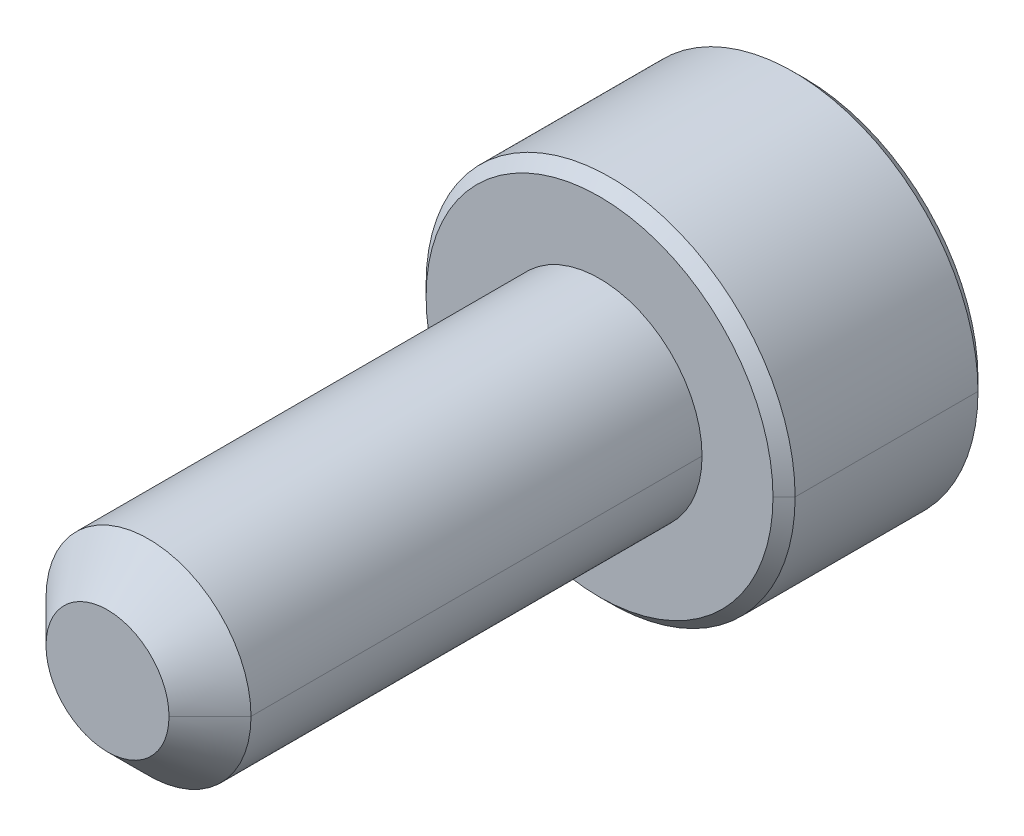
ISO-10303-21;
HEADER;
FILE_DESCRIPTION(('STEP AP214'),'2;1');
FILE_NAME('part.step','',(''),(''),'','','');
FILE_SCHEMA(('AUTOMOTIVE_DESIGN { 1 0 10303 214 1 1 1 1 }'));
ENDSEC;
DATA;
#1=APPLICATION_CONTEXT('core data for automotive mechanical design processes');
#2=APPLICATION_PROTOCOL_DEFINITION('international standard','automotive_design',2000,#1);
#3=PRODUCT_CONTEXT('',#1,'mechanical');
#4=PRODUCT('Part','Part','',(#3));
#5=PRODUCT_RELATED_PRODUCT_CATEGORY('part','',(#4));
#6=PRODUCT_DEFINITION_FORMATION('','',#4);
#7=PRODUCT_DEFINITION_CONTEXT('part definition',#1,'design');
#8=PRODUCT_DEFINITION('design','',#6,#7);
#9=PRODUCT_DEFINITION_SHAPE('','',#8);
#10=(LENGTH_UNIT() NAMED_UNIT(*) SI_UNIT(.MILLI.,.METRE.));
#11=(NAMED_UNIT(*) PLANE_ANGLE_UNIT() SI_UNIT($,.RADIAN.));
#12=(NAMED_UNIT(*) SI_UNIT($,.STERADIAN.) SOLID_ANGLE_UNIT());
#13=UNCERTAINTY_MEASURE_WITH_UNIT(LENGTH_MEASURE(1.E-05),#10,'distance_accuracy_value','');
#14=(GEOMETRIC_REPRESENTATION_CONTEXT(3) GLOBAL_UNCERTAINTY_ASSIGNED_CONTEXT((#13)) GLOBAL_UNIT_ASSIGNED_CONTEXT((#10,
#11,#12)) REPRESENTATION_CONTEXT('',''));
#15=CARTESIAN_POINT('',(0.,0.,0.));
#16=DIRECTION('',(0.,0.,1.));
#17=DIRECTION('',(1.,0.,0.));
#18=AXIS2_PLACEMENT_3D('',#15,#16,#17);
#19=CARTESIAN_POINT('',(0.,0.,0.));
#20=DIRECTION('',(0.,0.,-1.));
#21=DIRECTION('',(-1.,0.,0.));
#22=AXIS2_PLACEMENT_3D('',#19,#20,#21);
#23=CONICAL_SURFACE('',#22,0.75,0.785398163397448);
#24=CARTESIAN_POINT('',(0.,0.,0.));
#25=DIRECTION('',(0.,0.,1.));
#26=DIRECTION('',(1.,0.,0.));
#27=AXIS2_PLACEMENT_3D('',#24,#25,#26);
#28=CIRCLE('',#27,0.75);
#29=CARTESIAN_POINT('',(0.75,0.,0.));
#30=VERTEX_POINT('',#29);
#31=CARTESIAN_POINT('',(-0.75,0.,0.));
#32=VERTEX_POINT('',#31);
#33=EDGE_CURVE('E43',#30,#32,#28,.T.);
#34=ORIENTED_EDGE('',*,*,#33,.F.);
#35=DIRECTION('',(0.707106781186547,0.,-0.707106781186548));
#36=VECTOR('',#35,1.);
#37=CARTESIAN_POINT('',(0.75,0.,0.));
#38=LINE('',#37,#36);
#39=CARTESIAN_POINT('',(1.24999999999997,0.,-0.500000000000028));
#40=VERTEX_POINT('',#39);
#41=EDGE_CURVE('E11',#30,#40,#38,.T.);
#42=ORIENTED_EDGE('',*,*,#41,.T.);
#43=CARTESIAN_POINT('',(0.,0.,-0.500000000000028));
#44=DIRECTION('',(0.,0.,-1.));
#45=DIRECTION('',(1.,0.,0.));
#46=AXIS2_PLACEMENT_3D('',#43,#44,#45);
#47=CIRCLE('',#46,1.25);
#48=CARTESIAN_POINT('',(-1.25000000000003,0.,-0.500000000000028));
#49=VERTEX_POINT('',#48);
#50=EDGE_CURVE('E437',#49,#40,#47,.T.);
#51=ORIENTED_EDGE('',*,*,#50,.F.);
#52=DIRECTION('',(-0.707106781186547,0.,-0.707106781186548));
#53=VECTOR('',#52,1.);
#54=CARTESIAN_POINT('',(-0.75,0.,0.));
#55=LINE('',#54,#53);
#56=EDGE_CURVE('E476',#32,#49,#55,.T.);
#57=ORIENTED_EDGE('',*,*,#56,.F.);
#58=EDGE_LOOP('',(#34,#42,#51,#57));
#59=FACE_BOUND('',#58,.T.);
#60=ADVANCED_FACE('F16',(#59),#23,.T.);
#61=CARTESIAN_POINT('',(1.10154940724527E-13,0.,-6.135));
#62=DIRECTION('',(0.,0.,-1.));
#63=DIRECTION('',(-1.,0.,0.));
#64=AXIS2_PLACEMENT_3D('',#61,#62,#63);
#65=CONICAL_SURFACE('',#64,2.25,0.785398163397456);
#66=CARTESIAN_POINT('',(0.,0.,-6.));
#67=DIRECTION('',(0.,0.,1.));
#68=DIRECTION('',(-1.,0.,0.));
#69=AXIS2_PLACEMENT_3D('',#66,#67,#68);
#70=CIRCLE('',#69,2.115);
#71=CARTESIAN_POINT('',(2.11500000000005,0.,-6.));
#72=VERTEX_POINT('',#71);
#73=CARTESIAN_POINT('',(-2.11499999999994,0.,-6.));
#74=VERTEX_POINT('',#73);
#75=EDGE_CURVE('E328',#72,#74,#70,.T.);
#76=ORIENTED_EDGE('',*,*,#75,.F.);
#77=DIRECTION('',(0.707106781186554,0.,-0.707106781186541));
#78=VECTOR('',#77,1.);
#79=CARTESIAN_POINT('',(2.2500000000001,0.,-6.135));
#80=LINE('',#79,#78);
#81=CARTESIAN_POINT('',(2.25000000000011,0.,-6.135));
#82=VERTEX_POINT('',#81);
#83=EDGE_CURVE('E29',#72,#82,#80,.T.);
#84=ORIENTED_EDGE('',*,*,#83,.T.);
#85=CARTESIAN_POINT('',(1.10154940724527E-13,0.,-6.135));
#86=DIRECTION('',(0.,0.,-1.));
#87=DIRECTION('',(-1.,0.,0.));
#88=AXIS2_PLACEMENT_3D('',#85,#86,#87);
#89=CIRCLE('',#88,2.25);
#90=CARTESIAN_POINT('',(-2.24999999999989,0.,-6.135));
#91=VERTEX_POINT('',#90);
#92=EDGE_CURVE('E443',#91,#82,#89,.T.);
#93=ORIENTED_EDGE('',*,*,#92,.F.);
#94=DIRECTION('',(-0.707106781186554,0.,-0.707106781186542));
#95=VECTOR('',#94,1.);
#96=CARTESIAN_POINT('',(-2.24999999999988,0.,-6.135));
#97=LINE('',#96,#95);
#98=EDGE_CURVE('E142',#74,#91,#97,.T.);
#99=ORIENTED_EDGE('',*,*,#98,.F.);
#100=EDGE_LOOP('',(#76,#84,#93,#99));
#101=FACE_BOUND('',#100,.T.);
#102=ADVANCED_FACE('F242',(#101),#65,.T.);
#103=CARTESIAN_POINT('',(0.,0.,-8.5));
#104=DIRECTION('',(0.,0.,1.));
#105=DIRECTION('',(1.,0.,0.));
#106=AXIS2_PLACEMENT_3D('',#103,#104,#105);
#107=CONICAL_SURFACE('',#106,2.115,0.785398163397446);
#108=CARTESIAN_POINT('',(0.,0.,-8.5));
#109=DIRECTION('',(0.,0.,-1.));
#110=DIRECTION('',(-1.,0.,0.));
#111=AXIS2_PLACEMENT_3D('',#108,#109,#110);
#112=CIRCLE('',#111,2.115);
#113=CARTESIAN_POINT('',(-2.11499999999995,0.,-8.5));
#114=VERTEX_POINT('',#113);
#115=CARTESIAN_POINT('',(2.11500000000006,0.,-8.5));
#116=VERTEX_POINT('',#115);
#117=EDGE_CURVE('E157',#114,#116,#112,.T.);
#118=ORIENTED_EDGE('',*,*,#117,.F.);
#119=DIRECTION('',(-0.707106781186547,0.,0.707106781186548));
#120=VECTOR('',#119,1.);
#121=CARTESIAN_POINT('',(-2.11499999999994,0.,-8.5));
#122=LINE('',#121,#120);
#123=CARTESIAN_POINT('',(-2.24999999999997,0.,-8.365));
#124=VERTEX_POINT('',#123);
#125=EDGE_CURVE('E187',#114,#124,#122,.T.);
#126=ORIENTED_EDGE('',*,*,#125,.T.);
#127=CARTESIAN_POINT('',(0.,0.,-8.365));
#128=DIRECTION('',(0.,0.,1.));
#129=DIRECTION('',(-1.,0.,0.));
#130=AXIS2_PLACEMENT_3D('',#127,#128,#129);
#131=CIRCLE('',#130,2.25);
#132=CARTESIAN_POINT('',(2.25000000000003,0.,-8.365));
#133=VERTEX_POINT('',#132);
#134=EDGE_CURVE('E169',#133,#124,#131,.T.);
#135=ORIENTED_EDGE('',*,*,#134,.F.);
#136=DIRECTION('',(0.707106781186547,0.,0.707106781186548));
#137=VECTOR('',#136,1.);
#138=CARTESIAN_POINT('',(2.11500000000005,0.,-8.5));
#139=LINE('',#138,#137);
#140=EDGE_CURVE('E166',#116,#133,#139,.T.);
#141=ORIENTED_EDGE('',*,*,#140,.F.);
#142=EDGE_LOOP('',(#118,#126,#135,#141));
#143=FACE_BOUND('',#142,.T.);
#144=ADVANCED_FACE('F167',(#143),#107,.T.);
#145=CARTESIAN_POINT('',(0.,0.,-8.5));
#146=DIRECTION('',(0.,0.,-1.));
#147=DIRECTION('',(-1.,0.,0.));
#148=AXIS2_PLACEMENT_3D('',#145,#146,#147);
#149=CONICAL_SURFACE('',#148,1.15470053837925,0.78539816339745);
#150=CARTESIAN_POINT('',(-0.999999999999945,0.,-8.34529946162075));
#151=CARTESIAN_POINT('',(-0.999999999999945,0.267949192430957,-8.34529946162075));
#152=CARTESIAN_POINT('',(-0.999999999999945,0.57735026918964,-8.49999999999995));
#153=B_SPLINE_CURVE_WITH_KNOTS('',2,(#150,#151,#152),.UNSPECIFIED.,.F.,.F.,(3,3),(0.,1.),.UNSPECIFIED.);
#154=CARTESIAN_POINT('',(-0.999999999999945,0.,-8.34529946162074));
#155=VERTEX_POINT('',#154);
#156=CARTESIAN_POINT('',(-1.,0.57735026918964,-8.5));
#157=VERTEX_POINT('',#156);
#158=EDGE_CURVE('E392',#155,#157,#153,.T.);
#159=ORIENTED_EDGE('',*,*,#158,.F.);
#160=DIRECTION('',(-0.707106781186549,0.,-0.707106781186546));
#161=VECTOR('',#160,1.);
#162=CARTESIAN_POINT('',(-1.15470053837919,0.,-8.5));
#163=LINE('',#162,#161);
#164=CARTESIAN_POINT('',(-1.15470053837919,0.,-8.5));
#165=VERTEX_POINT('',#164);
#166=EDGE_CURVE('E209',#155,#165,#163,.T.);
#167=ORIENTED_EDGE('',*,*,#166,.T.);
#168=CARTESIAN_POINT('',(0.,0.,-8.5));
#169=DIRECTION('',(0.,0.,-1.));
#170=DIRECTION('',(-1.,0.,0.));
#171=AXIS2_PLACEMENT_3D('',#168,#169,#170);
#172=CIRCLE('',#171,1.15470053837925);
#173=EDGE_CURVE('E397',#165,#157,#172,.T.);
#174=ORIENTED_EDGE('',*,*,#173,.T.);
#175=EDGE_LOOP('',(#159,#167,#174));
#176=FACE_BOUND('',#175,.T.);
#177=ADVANCED_FACE('F245',(#176),#149,.F.);
#178=CARTESIAN_POINT('',(0.,0.,-8.5));
#179=DIRECTION('',(0.,0.,1.));
#180=DIRECTION('',(1.,0.,0.));
#181=AXIS2_PLACEMENT_3D('',#178,#179,#180);
#182=CYLINDRICAL_SURFACE('',#181,2.25);
#183=ORIENTED_EDGE('',*,*,#134,.T.);
#184=DIRECTION('',(0.,0.,1.));
#185=VECTOR('',#184,1.);
#186=CARTESIAN_POINT('',(-2.24999999999994,0.,-8.5));
#187=LINE('',#186,#185);
#188=EDGE_CURVE('E462',#124,#91,#187,.T.);
#189=ORIENTED_EDGE('',*,*,#188,.T.);
#190=ORIENTED_EDGE('',*,*,#92,.T.);
#191=DIRECTION('',(0.,0.,1.));
#192=VECTOR('',#191,1.);
#193=CARTESIAN_POINT('',(2.25000000000005,0.,-8.5));
#194=LINE('',#193,#192);
#195=EDGE_CURVE('E197',#133,#82,#194,.T.);
#196=ORIENTED_EDGE('',*,*,#195,.F.);
#197=EDGE_LOOP('',(#183,#189,#190,#196));
#198=FACE_BOUND('',#197,.T.);
#199=ADVANCED_FACE('F407',(#198),#182,.T.);
#200=CARTESIAN_POINT('',(0.,0.,-6.));
#201=DIRECTION('',(0.,0.,1.));
#202=DIRECTION('',(1.,0.,0.));
#203=AXIS2_PLACEMENT_3D('',#200,#201,#202);
#204=CYLINDRICAL_SURFACE('',#203,1.25);
#205=CARTESIAN_POINT('',(0.,0.,-6.));
#206=DIRECTION('',(0.,0.,1.));
#207=DIRECTION('',(-1.,0.,0.));
#208=AXIS2_PLACEMENT_3D('',#205,#206,#207);
#209=CIRCLE('',#208,1.25);
#210=CARTESIAN_POINT('',(1.25000000000005,0.,-6.));
#211=VERTEX_POINT('',#210);
#212=CARTESIAN_POINT('',(-1.24999999999995,0.,-6.));
#213=VERTEX_POINT('',#212);
#214=EDGE_CURVE('E436',#211,#213,#209,.T.);
#215=ORIENTED_EDGE('',*,*,#214,.T.);
#216=DIRECTION('',(0.,0.,1.));
#217=VECTOR('',#216,1.);
#218=CARTESIAN_POINT('',(-1.24999999999994,0.,-6.));
#219=LINE('',#218,#217);
#220=EDGE_CURVE('E426',#213,#49,#219,.T.);
#221=ORIENTED_EDGE('',*,*,#220,.T.);
#222=ORIENTED_EDGE('',*,*,#50,.T.);
#223=DIRECTION('',(0.,0.,1.));
#224=VECTOR('',#223,1.);
#225=CARTESIAN_POINT('',(1.25000000000005,0.,-6.));
#226=LINE('',#225,#224);
#227=EDGE_CURVE('E440',#211,#40,#226,.T.);
#228=ORIENTED_EDGE('',*,*,#227,.F.);
#229=EDGE_LOOP('',(#215,#221,#222,#228));
#230=FACE_BOUND('',#229,.T.);
#231=ADVANCED_FACE('F413',(#230),#204,.T.);
#232=CARTESIAN_POINT('',(0.,0.,-6.));
#233=DIRECTION('',(0.,0.,1.));
#234=DIRECTION('',(1.,0.,0.));
#235=AXIS2_PLACEMENT_3D('',#232,#233,#234);
#236=CYLINDRICAL_SURFACE('',#235,1.25);
#237=ORIENTED_EDGE('',*,*,#220,.F.);
#238=CARTESIAN_POINT('',(0.,0.,-6.));
#239=DIRECTION('',(0.,0.,1.));
#240=DIRECTION('',(-1.,0.,0.));
#241=AXIS2_PLACEMENT_3D('',#238,#239,#240);
#242=CIRCLE('',#241,1.25);
#243=EDGE_CURVE('E429',#213,#211,#242,.T.);
#244=ORIENTED_EDGE('',*,*,#243,.T.);
#245=ORIENTED_EDGE('',*,*,#227,.T.);
#246=CARTESIAN_POINT('',(0.,0.,-0.500000000000028));
#247=DIRECTION('',(0.,0.,-1.));
#248=DIRECTION('',(1.,0.,0.));
#249=AXIS2_PLACEMENT_3D('',#246,#247,#248);
#250=CIRCLE('',#249,1.25);
#251=EDGE_CURVE('E431',#40,#49,#250,.T.);
#252=ORIENTED_EDGE('',*,*,#251,.T.);
#253=EDGE_LOOP('',(#237,#244,#245,#252));
#254=FACE_BOUND('',#253,.T.);
#255=ADVANCED_FACE('F410',(#254),#236,.T.);
#256=CARTESIAN_POINT('',(0.,0.,0.));
#257=DIRECTION('',(0.,0.,1.));
#258=DIRECTION('',(1.,0.,0.));
#259=AXIS2_PLACEMENT_3D('',#256,#257,#258);
#260=PLANE('',#259);
#261=CARTESIAN_POINT('',(0.,0.,0.));
#262=DIRECTION('',(0.,0.,1.));
#263=DIRECTION('',(1.,0.,0.));
#264=AXIS2_PLACEMENT_3D('',#261,#262,#263);
#265=CIRCLE('',#264,0.75);
#266=EDGE_CURVE('E461',#32,#30,#265,.T.);
#267=ORIENTED_EDGE('',*,*,#266,.T.);
#268=ORIENTED_EDGE('',*,*,#33,.T.);
#269=EDGE_LOOP('',(#267,#268));
#270=FACE_BOUND('',#269,.T.);
#271=ADVANCED_FACE('F412',(#270),#260,.T.);
#272=CARTESIAN_POINT('',(0.,0.,-8.5));
#273=DIRECTION('',(0.,0.,1.));
#274=DIRECTION('',(1.,0.,0.));
#275=AXIS2_PLACEMENT_3D('',#272,#273,#274);
#276=CYLINDRICAL_SURFACE('',#275,2.25);
#277=ORIENTED_EDGE('',*,*,#188,.F.);
#278=CARTESIAN_POINT('',(0.,0.,-8.365));
#279=DIRECTION('',(0.,0.,1.));
#280=DIRECTION('',(-1.,0.,0.));
#281=AXIS2_PLACEMENT_3D('',#278,#279,#280);
#282=CIRCLE('',#281,2.25);
#283=EDGE_CURVE('E456',#124,#133,#282,.T.);
#284=ORIENTED_EDGE('',*,*,#283,.T.);
#285=ORIENTED_EDGE('',*,*,#195,.T.);
#286=CARTESIAN_POINT('',(1.10154940724527E-13,0.,-6.135));
#287=DIRECTION('',(0.,0.,-1.));
#288=DIRECTION('',(-1.,0.,0.));
#289=AXIS2_PLACEMENT_3D('',#286,#287,#288);
#290=CIRCLE('',#289,2.25);
#291=EDGE_CURVE('E189',#82,#91,#290,.T.);
#292=ORIENTED_EDGE('',*,*,#291,.T.);
#293=EDGE_LOOP('',(#277,#284,#285,#292));
#294=FACE_BOUND('',#293,.T.);
#295=ADVANCED_FACE('F408',(#294),#276,.T.);
#296=CARTESIAN_POINT('',(0.,0.,-8.5));
#297=DIRECTION('',(0.,0.,-1.));
#298=DIRECTION('',(0.,-1.,0.));
#299=AXIS2_PLACEMENT_3D('',#296,#297,#298);
#300=PLANE('',#299);
#301=CARTESIAN_POINT('',(0.,0.,-8.5));
#302=DIRECTION('',(0.,0.,-1.));
#303=DIRECTION('',(-1.,0.,0.));
#304=AXIS2_PLACEMENT_3D('',#301,#302,#303);
#305=CIRCLE('',#304,2.115);
#306=EDGE_CURVE('E182',#116,#114,#305,.T.);
#307=ORIENTED_EDGE('',*,*,#306,.T.);
#308=ORIENTED_EDGE('',*,*,#117,.T.);
#309=EDGE_LOOP('',(#307,#308));
#310=FACE_BOUND('',#309,.T.);
#311=CARTESIAN_POINT('',(0.,0.,-8.5));
#312=DIRECTION('',(0.,0.,-1.));
#313=DIRECTION('',(-1.,0.,0.));
#314=AXIS2_PLACEMENT_3D('',#311,#312,#313);
#315=CIRCLE('',#314,1.15470053837925);
#316=CARTESIAN_POINT('',(0.,1.15470053837928,-8.5));
#317=VERTEX_POINT('',#316);
#318=EDGE_CURVE('E205',#157,#317,#315,.T.);
#319=ORIENTED_EDGE('',*,*,#318,.F.);
#320=ORIENTED_EDGE('',*,*,#173,.F.);
#321=CARTESIAN_POINT('',(0.,0.,-8.5));
#322=DIRECTION('',(0.,0.,-1.));
#323=DIRECTION('',(-1.,0.,0.));
#324=AXIS2_PLACEMENT_3D('',#321,#322,#323);
#325=CIRCLE('',#324,1.15470053837925);
#326=CARTESIAN_POINT('',(-0.999999999999917,-0.577350269189591,-8.5));
#327=VERTEX_POINT('',#326);
#328=EDGE_CURVE('E321',#327,#165,#325,.T.);
#329=ORIENTED_EDGE('',*,*,#328,.F.);
#330=CARTESIAN_POINT('',(0.,0.,-8.5));
#331=DIRECTION('',(0.,0.,-1.));
#332=DIRECTION('',(-1.,0.,0.));
#333=AXIS2_PLACEMENT_3D('',#330,#331,#332);
#334=CIRCLE('',#333,1.15470053837925);
#335=CARTESIAN_POINT('',(0.,-1.15470053837923,-8.5));
#336=VERTEX_POINT('',#335);
#337=EDGE_CURVE('E274',#336,#327,#334,.T.);
#338=ORIENTED_EDGE('',*,*,#337,.F.);
#339=CARTESIAN_POINT('',(0.,0.,-8.5));
#340=DIRECTION('',(0.,0.,-1.));
#341=DIRECTION('',(-1.,0.,0.));
#342=AXIS2_PLACEMENT_3D('',#339,#340,#341);
#343=CIRCLE('',#342,1.15470053837925);
#344=CARTESIAN_POINT('',(1.,-0.577350269189584,-8.5));
#345=VERTEX_POINT('',#344);
#346=EDGE_CURVE('E264',#345,#336,#343,.T.);
#347=ORIENTED_EDGE('',*,*,#346,.F.);
#348=CARTESIAN_POINT('',(0.,0.,-8.5));
#349=DIRECTION('',(0.,0.,-1.));
#350=DIRECTION('',(-1.,0.,0.));
#351=AXIS2_PLACEMENT_3D('',#348,#349,#350);
#352=CIRCLE('',#351,1.15470053837925);
#353=CARTESIAN_POINT('',(1.00000000000006,0.577350269189633,-8.5));
#354=VERTEX_POINT('',#353);
#355=EDGE_CURVE('E273',#354,#345,#352,.T.);
#356=ORIENTED_EDGE('',*,*,#355,.F.);
#357=CARTESIAN_POINT('',(0.,0.,-8.5));
#358=DIRECTION('',(0.,0.,-1.));
#359=DIRECTION('',(-1.,0.,0.));
#360=AXIS2_PLACEMENT_3D('',#357,#358,#359);
#361=CIRCLE('',#360,1.15470053837925);
#362=EDGE_CURVE('E324',#317,#354,#361,.T.);
#363=ORIENTED_EDGE('',*,*,#362,.F.);
#364=EDGE_LOOP('',(#319,#320,#329,#338,#347,#356,#363));
#365=FACE_BOUND('',#364,.T.);
#366=ADVANCED_FACE('F180',(#310,#365),#300,.T.);
#367=CARTESIAN_POINT('',(0.,0.,-6.));
#368=DIRECTION('',(0.,0.,-1.));
#369=DIRECTION('',(0.,-1.,0.));
#370=AXIS2_PLACEMENT_3D('',#367,#368,#369);
#371=PLANE('',#370);
#372=CARTESIAN_POINT('',(0.,0.,-6.));
#373=DIRECTION('',(0.,0.,1.));
#374=DIRECTION('',(-1.,0.,0.));
#375=AXIS2_PLACEMENT_3D('',#372,#373,#374);
#376=CIRCLE('',#375,2.115);
#377=EDGE_CURVE('E184',#74,#72,#376,.T.);
#378=ORIENTED_EDGE('',*,*,#377,.T.);
#379=ORIENTED_EDGE('',*,*,#75,.T.);
#380=EDGE_LOOP('',(#378,#379));
#381=FACE_BOUND('',#380,.T.);
#382=ORIENTED_EDGE('',*,*,#214,.F.);
#383=ORIENTED_EDGE('',*,*,#243,.F.);
#384=EDGE_LOOP('',(#382,#383));
#385=FACE_BOUND('',#384,.T.);
#386=ADVANCED_FACE('F306',(#381,#385),#371,.F.);
#387=CARTESIAN_POINT('',(0.,0.,-8.5));
#388=DIRECTION('',(0.,0.,-1.));
#389=DIRECTION('',(-1.,0.,0.));
#390=AXIS2_PLACEMENT_3D('',#387,#388,#389);
#391=CONICAL_SURFACE('',#390,1.15470053837925,0.78539816339745);
#392=ORIENTED_EDGE('',*,*,#362,.T.);
#393=CARTESIAN_POINT('',(0.,1.15470053837927,-8.5));
#394=CARTESIAN_POINT('',(0.266698593283916,1.00072203375434,-8.34602149537538));
#395=CARTESIAN_POINT('',(0.498157365873924,0.8670892490932,-8.34530172515193));
#396=CARTESIAN_POINT('',(0.730801664071359,0.73277200090348,-8.34457826828476));
#397=CARTESIAN_POINT('',(1.00000000000006,0.577350269189643,-8.5));
#398=B_SPLINE_CURVE_WITH_KNOTS('',2,(#393,#394,#395,#396,#397),.UNSPECIFIED.,.F.,.F.,(3,2,3),
(0.,0.5,1.),.UNSPECIFIED.);
#399=EDGE_CURVE('E222',#317,#354,#398,.T.);
#400=ORIENTED_EDGE('',*,*,#399,.F.);
#401=EDGE_LOOP('',(#392,#400));
#402=FACE_BOUND('',#401,.T.);
#403=ADVANCED_FACE('F255',(#402),#391,.F.);
#404=CARTESIAN_POINT('',(0.,0.,-8.5));
#405=DIRECTION('',(0.,0.,-1.));
#406=DIRECTION('',(-1.,0.,0.));
#407=AXIS2_PLACEMENT_3D('',#404,#405,#406);
#408=CONICAL_SURFACE('',#407,1.15470053837925,0.78539816339745);
#409=ORIENTED_EDGE('',*,*,#355,.T.);
#410=CARTESIAN_POINT('',(1.00000000000003,0.577350269189632,-8.5));
#411=CARTESIAN_POINT('',(1.00000000000003,0.268289835379452,-8.34546978309495));
#412=CARTESIAN_POINT('',(1.00000000000003,6.29475276350214E-05,-8.34529946360195));
#413=CARTESIAN_POINT('',(1.00000000000003,-0.267609261830277,-8.34512949632031));
#414=CARTESIAN_POINT('',(1.00000000000003,-0.577350269189585,-8.49999999999997));
#415=B_SPLINE_CURVE_WITH_KNOTS('',2,(#410,#411,#412,#413,#414),.UNSPECIFIED.,.F.,.F.,(3,2,3),
(0.,0.5,1.),.UNSPECIFIED.);
#416=EDGE_CURVE('E281',#354,#345,#415,.T.);
#417=ORIENTED_EDGE('',*,*,#416,.F.);
#418=EDGE_LOOP('',(#409,#417));
#419=FACE_BOUND('',#418,.T.);
#420=ADVANCED_FACE('F250',(#419),#408,.F.);
#421=CARTESIAN_POINT('',(0.,0.,-8.5));
#422=DIRECTION('',(0.,0.,-1.));
#423=DIRECTION('',(-1.,0.,0.));
#424=AXIS2_PLACEMENT_3D('',#421,#422,#423);
#425=CONICAL_SURFACE('',#424,1.15470053837925,0.78539816339745);
#426=ORIENTED_EDGE('',*,*,#346,.T.);
#427=CARTESIAN_POINT('',(1.00000000000004,-0.577350269189653,-8.49999999999996));
#428=CARTESIAN_POINT('',(0.733301406716383,-0.731328773814465,-8.34602149537526));
#429=CARTESIAN_POINT('',(0.501842634126072,-0.864961558475781,-8.34530172515183));
#430=CARTESIAN_POINT('',(0.269198335928583,-0.999278806665533,-8.34457826828468));
#431=CARTESIAN_POINT('',(0.,-1.15470053837927,-8.50000000000004));
#432=B_SPLINE_CURVE_WITH_KNOTS('',2,(#427,#428,#429,#430,#431),.UNSPECIFIED.,.F.,.F.,(3,2,3),
(0.,0.5,1.),.UNSPECIFIED.);
#433=EDGE_CURVE('E282',#345,#336,#432,.T.);
#434=ORIENTED_EDGE('',*,*,#433,.F.);
#435=EDGE_LOOP('',(#426,#434));
#436=FACE_BOUND('',#435,.T.);
#437=ADVANCED_FACE('F254',(#436),#425,.F.);
#438=CARTESIAN_POINT('',(0.,0.,-8.5));
#439=DIRECTION('',(0.,0.,-1.));
#440=DIRECTION('',(-1.,0.,0.));
#441=AXIS2_PLACEMENT_3D('',#438,#439,#440);
#442=CONICAL_SURFACE('',#441,1.15470053837925,0.78539816339745);
#443=ORIENTED_EDGE('',*,*,#337,.T.);
#444=CARTESIAN_POINT('',(0.,-1.15470053837925,-8.5));
#445=CARTESIAN_POINT('',(-0.266698593282407,-1.00072203375514,-8.34602149537569));
#446=CARTESIAN_POINT('',(-0.498157365873901,-0.867089249093146,-8.34530172515183));
#447=CARTESIAN_POINT('',(-0.730801664070624,-0.732772000903836,-8.34457826828424));
#448=CARTESIAN_POINT('',(-0.999999999999946,-0.577350269189643,-8.5));
#449=B_SPLINE_CURVE_WITH_KNOTS('',2,(#444,#445,#446,#447,#448),.UNSPECIFIED.,.F.,.F.,(3,2,3),
(0.,0.5,1.),.UNSPECIFIED.);
#450=EDGE_CURVE('E95',#336,#327,#449,.T.);
#451=ORIENTED_EDGE('',*,*,#450,.F.);
#452=EDGE_LOOP('',(#443,#451));
#453=FACE_BOUND('',#452,.T.);
#454=ADVANCED_FACE('F534',(#453),#442,.F.);
#455=CARTESIAN_POINT('',(0.,0.,-8.5));
#456=DIRECTION('',(0.,0.,-1.));
#457=DIRECTION('',(-1.,0.,0.));
#458=AXIS2_PLACEMENT_3D('',#455,#456,#457);
#459=CONICAL_SURFACE('',#458,1.15470053837925,0.78539816339745);
#460=ORIENTED_EDGE('',*,*,#166,.F.);
#461=CARTESIAN_POINT('',(-0.999999999999945,-0.577350269189592,-8.5));
#462=CARTESIAN_POINT('',(-0.999999999999945,-0.267949192431205,-8.34529946162075));
#463=CARTESIAN_POINT('',(-0.999999999999945,0.,-8.34529946162075));
#464=B_SPLINE_CURVE_WITH_KNOTS('',2,(#461,#462,#463),.UNSPECIFIED.,.F.,.F.,(3,3),(0.,1.),.UNSPECIFIED.);
#465=EDGE_CURVE('E79',#327,#155,#464,.T.);
#466=ORIENTED_EDGE('',*,*,#465,.F.);
#467=ORIENTED_EDGE('',*,*,#328,.T.);
#468=EDGE_LOOP('',(#460,#466,#467));
#469=FACE_BOUND('',#468,.T.);
#470=ADVANCED_FACE('F542',(#469),#459,.F.);
#471=CARTESIAN_POINT('',(0.,0.,-8.5));
#472=DIRECTION('',(0.,0.,-1.));
#473=DIRECTION('',(-1.,0.,0.));
#474=AXIS2_PLACEMENT_3D('',#471,#472,#473);
#475=CONICAL_SURFACE('',#474,1.15470053837925,0.78539816339745);
#476=ORIENTED_EDGE('',*,*,#318,.T.);
#477=CARTESIAN_POINT('',(-1.,0.577350269189651,-8.49999999999992));
#478=CARTESIAN_POINT('',(-0.733301406715933,0.731328773814704,-8.34602149537537));
#479=CARTESIAN_POINT('',(-0.501842634126065,0.864961558475765,-8.34530172515192));
#480=CARTESIAN_POINT('',(-0.269198335928788,0.999278806665394,-8.34457826828474));
#481=CARTESIAN_POINT('',(0.,1.1547005383793,-8.49999999999997));
#482=B_SPLINE_CURVE_WITH_KNOTS('',2,(#477,#478,#479,#480,#481),.UNSPECIFIED.,.F.,.F.,(3,2,3),
(0.,0.5,1.),.UNSPECIFIED.);
#483=EDGE_CURVE('E176',#157,#317,#482,.T.);
#484=ORIENTED_EDGE('',*,*,#483,.F.);
#485=EDGE_LOOP('',(#476,#484));
#486=FACE_BOUND('',#485,.T.);
#487=ADVANCED_FACE('F18',(#486),#475,.F.);
#488=CARTESIAN_POINT('',(0.999999999999946,1.73205080756887,-7.));
#489=DIRECTION('',(0.,0.,-1.));
#490=DIRECTION('',(0.,-1.,0.));
#491=AXIS2_PLACEMENT_3D('',#488,#489,#490);
#492=PLANE('',#491);
#493=DIRECTION('',(0.866025403784439,0.5,0.));
#494=VECTOR('',#493,1.);
#495=CARTESIAN_POINT('',(-1.,0.577350269189653,-6.99999999999992));
#496=LINE('',#495,#494);
#497=CARTESIAN_POINT('',(-1.,0.577350269189653,-6.99999999999992));
#498=VERTEX_POINT('',#497);
#499=CARTESIAN_POINT('',(0.,1.15470053837927,-7.));
#500=VERTEX_POINT('',#499);
#501=EDGE_CURVE('E202',#498,#500,#496,.T.);
#502=ORIENTED_EDGE('',*,*,#501,.T.);
#503=DIRECTION('',(0.866025403784439,-0.5,0.));
#504=VECTOR('',#503,1.);
#505=CARTESIAN_POINT('',(0.,1.15470053837927,-7.));
#506=LINE('',#505,#504);
#507=CARTESIAN_POINT('',(1.00000000000003,0.577350269189597,-7.));
#508=VERTEX_POINT('',#507);
#509=EDGE_CURVE('E206',#500,#508,#506,.T.);
#510=ORIENTED_EDGE('',*,*,#509,.T.);
#511=DIRECTION('',(0.,-1.,0.));
#512=VECTOR('',#511,1.);
#513=CARTESIAN_POINT('',(1.00000000000003,0.577350269189597,-7.));
#514=LINE('',#513,#512);
#515=CARTESIAN_POINT('',(1.,-0.577350269189674,-7.));
#516=VERTEX_POINT('',#515);
#517=EDGE_CURVE('E214',#508,#516,#514,.T.);
#518=ORIENTED_EDGE('',*,*,#517,.T.);
#519=DIRECTION('',(-0.866025403784439,-0.5,0.));
#520=VECTOR('',#519,1.);
#521=CARTESIAN_POINT('',(1.,-0.577350269189674,-7.));
#522=LINE('',#521,#520);
#523=CARTESIAN_POINT('',(0.,-1.15470053837924,-7.));
#524=VERTEX_POINT('',#523);
#525=EDGE_CURVE('E210',#516,#524,#522,.T.);
#526=ORIENTED_EDGE('',*,*,#525,.T.);
#527=DIRECTION('',(-0.866025403784439,0.5,0.));
#528=VECTOR('',#527,1.);
#529=CARTESIAN_POINT('',(0.,-1.15470053837924,-7.));
#530=LINE('',#529,#528);
#531=CARTESIAN_POINT('',(-0.999999999999945,-0.577350269189648,-7.));
#532=VERTEX_POINT('',#531);
#533=EDGE_CURVE('E215',#524,#532,#530,.T.);
#534=ORIENTED_EDGE('',*,*,#533,.T.);
#535=DIRECTION('',(0.,1.,0.));
#536=VECTOR('',#535,1.);
#537=CARTESIAN_POINT('',(-0.999999999999945,-0.577350269189648,-7.));
#538=LINE('',#537,#536);
#539=EDGE_CURVE('E334',#532,#498,#538,.T.);
#540=ORIENTED_EDGE('',*,*,#539,.T.);
#541=EDGE_LOOP('',(#502,#510,#518,#526,#534,#540));
#542=FACE_BOUND('',#541,.T.);
#543=ADVANCED_FACE('F239',(#542),#492,.T.);
#544=CARTESIAN_POINT('',(0.,1.15470053837927,-7.));
#545=DIRECTION('',(0.5,0.866025403784439,0.));
#546=DIRECTION('',(0.,0.,-1.));
#547=AXIS2_PLACEMENT_3D('',#544,#545,#546);
#548=PLANE('',#547);
#549=DIRECTION('',(0.,0.,-1.));
#550=VECTOR('',#549,1.);
#551=CARTESIAN_POINT('',(0.,1.15470053837927,-7.));
#552=LINE('',#551,#550);
#553=EDGE_CURVE('E331',#500,#317,#552,.T.);
#554=ORIENTED_EDGE('',*,*,#553,.T.);
#555=ORIENTED_EDGE('',*,*,#399,.T.);
#556=DIRECTION('',(0.,0.,-1.));
#557=VECTOR('',#556,1.);
#558=CARTESIAN_POINT('',(1.00000000000003,0.577350269189597,-7.));
#559=LINE('',#558,#557);
#560=EDGE_CURVE('E342',#508,#354,#559,.T.);
#561=ORIENTED_EDGE('',*,*,#560,.F.);
#562=ORIENTED_EDGE('',*,*,#509,.F.);
#563=EDGE_LOOP('',(#554,#555,#561,#562));
#564=FACE_BOUND('',#563,.T.);
#565=ADVANCED_FACE('F229',(#564),#548,.F.);
#566=CARTESIAN_POINT('',(1.00000000000003,0.577350269189597,-7.));
#567=DIRECTION('',(1.,0.,0.));
#568=DIRECTION('',(0.,1.,0.));
#569=AXIS2_PLACEMENT_3D('',#566,#567,#568);
#570=PLANE('',#569);
#571=ORIENTED_EDGE('',*,*,#560,.T.);
#572=ORIENTED_EDGE('',*,*,#416,.T.);
#573=DIRECTION('',(0.,0.,-1.));
#574=VECTOR('',#573,1.);
#575=CARTESIAN_POINT('',(1.,-0.577350269189674,-7.));
#576=LINE('',#575,#574);
#577=EDGE_CURVE('E277',#516,#345,#576,.T.);
#578=ORIENTED_EDGE('',*,*,#577,.F.);
#579=ORIENTED_EDGE('',*,*,#517,.F.);
#580=EDGE_LOOP('',(#571,#572,#578,#579));
#581=FACE_BOUND('',#580,.T.);
#582=ADVANCED_FACE('F238',(#581),#570,.F.);
#583=CARTESIAN_POINT('',(1.,-0.577350269189674,-7.));
#584=DIRECTION('',(0.5,-0.866025403784439,0.));
#585=DIRECTION('',(0.,0.,-1.));
#586=AXIS2_PLACEMENT_3D('',#583,#584,#585);
#587=PLANE('',#586);
#588=ORIENTED_EDGE('',*,*,#577,.T.);
#589=ORIENTED_EDGE('',*,*,#433,.T.);
#590=DIRECTION('',(0.,0.,-1.));
#591=VECTOR('',#590,1.);
#592=CARTESIAN_POINT('',(0.,-1.15470053837924,-7.));
#593=LINE('',#592,#591);
#594=EDGE_CURVE('E503',#524,#336,#593,.T.);
#595=ORIENTED_EDGE('',*,*,#594,.F.);
#596=ORIENTED_EDGE('',*,*,#525,.F.);
#597=EDGE_LOOP('',(#588,#589,#595,#596));
#598=FACE_BOUND('',#597,.T.);
#599=ADVANCED_FACE('F293',(#598),#587,.F.);
#600=CARTESIAN_POINT('',(0.,-1.15470053837924,-7.));
#601=DIRECTION('',(-0.5,-0.866025403784439,0.));
#602=DIRECTION('',(-0.866025403784439,0.5,0.));
#603=AXIS2_PLACEMENT_3D('',#600,#601,#602);
#604=PLANE('',#603);
#605=ORIENTED_EDGE('',*,*,#594,.T.);
#606=ORIENTED_EDGE('',*,*,#450,.T.);
#607=DIRECTION('',(0.,0.,-1.));
#608=VECTOR('',#607,1.);
#609=CARTESIAN_POINT('',(-0.999999999999945,-0.577350269189648,-7.));
#610=LINE('',#609,#608);
#611=EDGE_CURVE('E512',#532,#327,#610,.T.);
#612=ORIENTED_EDGE('',*,*,#611,.F.);
#613=ORIENTED_EDGE('',*,*,#533,.F.);
#614=EDGE_LOOP('',(#605,#606,#612,#613));
#615=FACE_BOUND('',#614,.T.);
#616=ADVANCED_FACE('F302',(#615),#604,.F.);
#617=CARTESIAN_POINT('',(-0.999999999999945,-0.577350269189648,-7.));
#618=DIRECTION('',(-1.,0.,0.));
#619=DIRECTION('',(0.,0.,1.));
#620=AXIS2_PLACEMENT_3D('',#617,#618,#619);
#621=PLANE('',#620);
#622=ORIENTED_EDGE('',*,*,#611,.T.);
#623=ORIENTED_EDGE('',*,*,#465,.T.);
#624=ORIENTED_EDGE('',*,*,#158,.T.);
#625=DIRECTION('',(0.,0.,-1.));
#626=VECTOR('',#625,1.);
#627=CARTESIAN_POINT('',(-1.,0.577350269189653,-6.99999999999992));
#628=LINE('',#627,#626);
#629=EDGE_CURVE('E603',#498,#157,#628,.T.);
#630=ORIENTED_EDGE('',*,*,#629,.F.);
#631=ORIENTED_EDGE('',*,*,#539,.F.);
#632=EDGE_LOOP('',(#622,#623,#624,#630,#631));
#633=FACE_BOUND('',#632,.T.);
#634=ADVANCED_FACE('F365',(#633),#621,.F.);
#635=CARTESIAN_POINT('',(-1.,0.577350269189653,-6.99999999999992));
#636=DIRECTION('',(-0.5,0.866025403784439,0.));
#637=DIRECTION('',(0.,0.,1.));
#638=AXIS2_PLACEMENT_3D('',#635,#636,#637);
#639=PLANE('',#638);
#640=ORIENTED_EDGE('',*,*,#629,.T.);
#641=ORIENTED_EDGE('',*,*,#483,.T.);
#642=ORIENTED_EDGE('',*,*,#553,.F.);
#643=ORIENTED_EDGE('',*,*,#501,.F.);
#644=EDGE_LOOP('',(#640,#641,#642,#643));
#645=FACE_BOUND('',#644,.T.);
#646=ADVANCED_FACE('F249',(#645),#639,.F.);
#647=CARTESIAN_POINT('',(0.,0.,-8.5));
#648=DIRECTION('',(0.,0.,1.));
#649=DIRECTION('',(1.,0.,0.));
#650=AXIS2_PLACEMENT_3D('',#647,#648,#649);
#651=CONICAL_SURFACE('',#650,2.115,0.785398163397446);
#652=ORIENTED_EDGE('',*,*,#125,.F.);
#653=ORIENTED_EDGE('',*,*,#306,.F.);
#654=ORIENTED_EDGE('',*,*,#140,.T.);
#655=ORIENTED_EDGE('',*,*,#283,.F.);
#656=EDGE_LOOP('',(#652,#653,#654,#655));
#657=FACE_BOUND('',#656,.T.);
#658=ADVANCED_FACE('F186',(#657),#651,.T.);
#659=CARTESIAN_POINT('',(1.10154940724527E-13,0.,-6.135));
#660=DIRECTION('',(0.,0.,-1.));
#661=DIRECTION('',(-1.,0.,0.));
#662=AXIS2_PLACEMENT_3D('',#659,#660,#661);
#663=CONICAL_SURFACE('',#662,2.25,0.785398163397456);
#664=ORIENTED_EDGE('',*,*,#83,.F.);
#665=ORIENTED_EDGE('',*,*,#377,.F.);
#666=ORIENTED_EDGE('',*,*,#98,.T.);
#667=ORIENTED_EDGE('',*,*,#291,.F.);
#668=EDGE_LOOP('',(#664,#665,#666,#667));
#669=FACE_BOUND('',#668,.T.);
#670=ADVANCED_FACE('F248',(#669),#663,.T.);
#671=CARTESIAN_POINT('',(0.,0.,0.));
#672=DIRECTION('',(0.,0.,-1.));
#673=DIRECTION('',(-1.,0.,0.));
#674=AXIS2_PLACEMENT_3D('',#671,#672,#673);
#675=CONICAL_SURFACE('',#674,0.75,0.785398163397448);
#676=ORIENTED_EDGE('',*,*,#41,.F.);
#677=ORIENTED_EDGE('',*,*,#266,.F.);
#678=ORIENTED_EDGE('',*,*,#56,.T.);
#679=ORIENTED_EDGE('',*,*,#251,.F.);
#680=EDGE_LOOP('',(#676,#677,#678,#679));
#681=FACE_BOUND('',#680,.T.);
#682=ADVANCED_FACE('F584',(#681),#675,.T.);
#683=CLOSED_SHELL('',(#60,#102,#144,#177,#199,#231,#255,#271,#295,#366,#386,#403,#420,#437,#454,
#470,#487,#543,#565,#582,#599,#616,#634,#646,#658,#670,#682));
#684=MANIFOLD_SOLID_BREP('B1',#683);
#685=ADVANCED_BREP_SHAPE_REPRESENTATION('',(#18,#684),#14);
#686=SHAPE_DEFINITION_REPRESENTATION(#9,#685);
ENDSEC;
END-ISO-10303-21;
